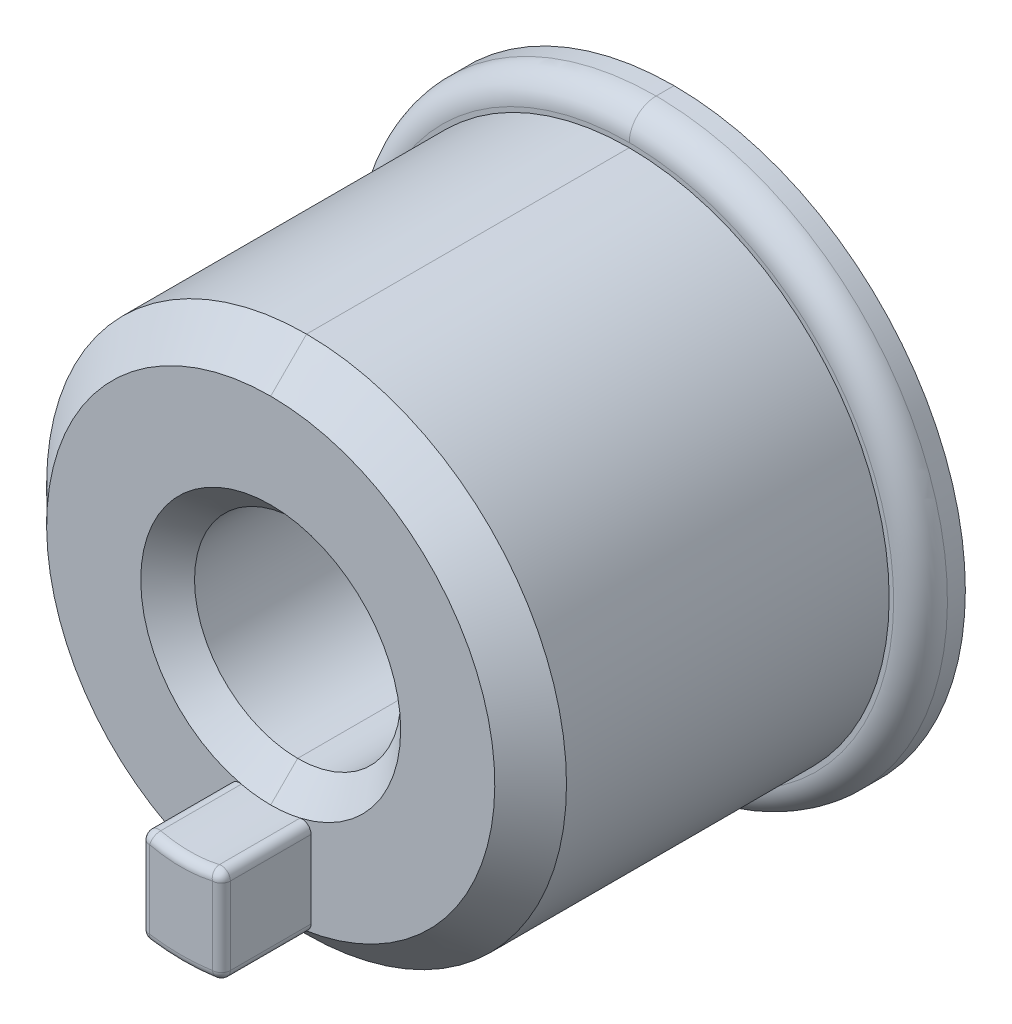
ISO-10303-21;
HEADER;
FILE_DESCRIPTION(('STEP AP214'),'2;1');
FILE_NAME('part.step','',(''),(''),'','','');
FILE_SCHEMA(('AUTOMOTIVE_DESIGN { 1 0 10303 214 1 1 1 1 }'));
ENDSEC;
DATA;
#1=APPLICATION_CONTEXT('core data for automotive mechanical design processes');
#2=APPLICATION_PROTOCOL_DEFINITION('international standard','automotive_design',2000,#1);
#3=PRODUCT_CONTEXT('',#1,'mechanical');
#4=PRODUCT('Part','Part','',(#3));
#5=PRODUCT_RELATED_PRODUCT_CATEGORY('part','',(#4));
#6=PRODUCT_DEFINITION_FORMATION('','',#4);
#7=PRODUCT_DEFINITION_CONTEXT('part definition',#1,'design');
#8=PRODUCT_DEFINITION('design','',#6,#7);
#9=PRODUCT_DEFINITION_SHAPE('','',#8);
#10=(LENGTH_UNIT() NAMED_UNIT(*) SI_UNIT(.MILLI.,.METRE.));
#11=(NAMED_UNIT(*) PLANE_ANGLE_UNIT() SI_UNIT($,.RADIAN.));
#12=(NAMED_UNIT(*) SI_UNIT($,.STERADIAN.) SOLID_ANGLE_UNIT());
#13=UNCERTAINTY_MEASURE_WITH_UNIT(LENGTH_MEASURE(1.E-05),#10,'distance_accuracy_value','');
#14=(GEOMETRIC_REPRESENTATION_CONTEXT(3) GLOBAL_UNCERTAINTY_ASSIGNED_CONTEXT((#13)) GLOBAL_UNIT_ASSIGNED_CONTEXT((#10,
#11,#12)) REPRESENTATION_CONTEXT('',''));
#15=CARTESIAN_POINT('',(0.,0.,0.));
#16=DIRECTION('',(0.,0.,1.));
#17=DIRECTION('',(1.,0.,0.));
#18=AXIS2_PLACEMENT_3D('',#15,#16,#17);
#19=CARTESIAN_POINT('',(0.35,-2.374342014117,20.8));
#20=DIRECTION('',(0.145833333332804,-0.989309172548725,0.));
#21=DIRECTION('',(1.13127562873E-12,1.667554982987E-13,-1.));
#22=AXIS2_PLACEMENT_3D('',#19,#20,#21);
#23=SPHERICAL_SURFACE('',#22,0.1);
#24=CARTESIAN_POINT('',(0.35,-2.374342014117,20.8));
#25=DIRECTION('',(0.,0.,-1.));
#26=DIRECTION('',(1.,0.,0.));
#27=AXIS2_PLACEMENT_3D('',#24,#25,#26);
#28=CIRCLE('',#27,0.1);
#29=CARTESIAN_POINT('',(0.45,-2.374342014117,20.8));
#30=VERTEX_POINT('',#29);
#31=CARTESIAN_POINT('',(0.3645834034215,-2.47327292104,20.8));
#32=VERTEX_POINT('',#31);
#33=EDGE_CURVE('E11',#30,#32,#28,.T.);
#34=ORIENTED_EDGE('',*,*,#33,.F.);
#35=CARTESIAN_POINT('',(0.35,-2.374342014117,20.8));
#36=DIRECTION('',(0.,1.,0.));
#37=DIRECTION('',(0.,0.,1.));
#38=AXIS2_PLACEMENT_3D('',#35,#36,#37);
#39=CIRCLE('',#38,0.1);
#40=CARTESIAN_POINT('',(0.3500000153566,-2.374342011853,20.9));
#41=VERTEX_POINT('',#40);
#42=EDGE_CURVE('E462',#41,#30,#39,.T.);
#43=ORIENTED_EDGE('',*,*,#42,.F.);
#44=CARTESIAN_POINT('',(0.35,-2.374342014117,20.8));
#45=DIRECTION('',(-0.989309172548725,-0.145833333332804,8.86110287343222E-13));
#46=DIRECTION('',(0.145833333332804,-0.989309172548725,0.));
#47=AXIS2_PLACEMENT_3D('',#44,#45,#46);
#48=CIRCLE('',#47,0.1);
#49=EDGE_CURVE('E288',#32,#41,#48,.T.);
#50=ORIENTED_EDGE('',*,*,#49,.F.);
#51=EDGE_LOOP('',(#34,#43,#50));
#52=FACE_BOUND('',#51,.T.);
#53=ADVANCED_FACE('F17',(#52),#23,.T.);
#54=CARTESIAN_POINT('',(0.35,-2.374342014117,20.95891989783));
#55=DIRECTION('',(0.,0.,-1.));
#56=DIRECTION('',(1.,0.,0.));
#57=AXIS2_PLACEMENT_3D('',#54,#55,#56);
#58=CYLINDRICAL_SURFACE('',#57,0.1);
#59=CARTESIAN_POINT('',(0.35,-2.374342014117,19.9));
#60=DIRECTION('',(0.,0.,1.));
#61=DIRECTION('',(0.145834735120993,-0.98930896591115,0.));
#62=AXIS2_PLACEMENT_3D('',#59,#60,#61);
#63=CIRCLE('',#62,0.1);
#64=CARTESIAN_POINT('',(0.3645834735121,-2.473272910708,19.9));
#65=VERTEX_POINT('',#64);
#66=CARTESIAN_POINT('',(0.45,-2.374342014117,19.9));
#67=VERTEX_POINT('',#66);
#68=EDGE_CURVE('E402',#65,#67,#63,.T.);
#69=ORIENTED_EDGE('',*,*,#68,.T.);
#70=DIRECTION('',(0.,0.,-1.));
#71=VECTOR('',#70,1.);
#72=CARTESIAN_POINT('',(0.45,-2.374342014117,20.8));
#73=LINE('',#72,#71);
#74=EDGE_CURVE('E361',#30,#67,#73,.T.);
#75=ORIENTED_EDGE('',*,*,#74,.F.);
#76=ORIENTED_EDGE('',*,*,#33,.T.);
#77=DIRECTION('',(-7.78765045660198E-08,-1.14798333802E-08,1.));
#78=VECTOR('',#77,1.);
#79=CARTESIAN_POINT('',(0.3645834384663,-2.473272915874,19.9));
#80=LINE('',#79,#78);
#81=EDGE_CURVE('E315',#65,#32,#80,.T.);
#82=ORIENTED_EDGE('',*,*,#81,.F.);
#83=EDGE_LOOP('',(#69,#75,#76,#82));
#84=FACE_BOUND('',#83,.T.);
#85=ADVANCED_FACE('F19',(#84),#58,.T.);
#86=CARTESIAN_POINT('',(0.,0.,-0.325));
#87=DIRECTION('',(0.,0.,1.));
#88=DIRECTION('',(-1.,0.,0.));
#89=AXIS2_PLACEMENT_3D('',#86,#87,#88);
#90=CYLINDRICAL_SURFACE('',#89,1.15);
#91=DIRECTION('',(0.,0.,1.));
#92=VECTOR('',#91,1.);
#93=CARTESIAN_POINT('',(0.,1.15,15.4));
#94=LINE('',#93,#92);
#95=CARTESIAN_POINT('',(0.,1.15,15.4));
#96=VERTEX_POINT('',#95);
#97=CARTESIAN_POINT('',(0.,1.15,19.6));
#98=VERTEX_POINT('',#97);
#99=EDGE_CURVE('E534',#96,#98,#94,.T.);
#100=ORIENTED_EDGE('',*,*,#99,.T.);
#101=CARTESIAN_POINT('',(0.,0.,19.6));
#102=DIRECTION('',(0.,0.,1.));
#103=DIRECTION('',(0.,1.,0.));
#104=AXIS2_PLACEMENT_3D('',#101,#102,#103);
#105=CIRCLE('',#104,1.15);
#106=CARTESIAN_POINT('',(-1.15,0.,19.6));
#107=VERTEX_POINT('',#106);
#108=EDGE_CURVE('E21',#98,#107,#105,.T.);
#109=ORIENTED_EDGE('',*,*,#108,.T.);
#110=CARTESIAN_POINT('',(0.,0.,19.6));
#111=DIRECTION('',(0.,0.,1.));
#112=DIRECTION('',(-1.,0.,0.));
#113=AXIS2_PLACEMENT_3D('',#110,#111,#112);
#114=CIRCLE('',#113,1.15);
#115=CARTESIAN_POINT('',(0.,-1.15,19.6));
#116=VERTEX_POINT('',#115);
#117=EDGE_CURVE('E353',#107,#116,#114,.T.);
#118=ORIENTED_EDGE('',*,*,#117,.T.);
#119=DIRECTION('',(0.,0.,1.));
#120=VECTOR('',#119,1.);
#121=CARTESIAN_POINT('',(0.,-1.15,15.4));
#122=LINE('',#121,#120);
#123=CARTESIAN_POINT('',(0.,-1.15,15.4));
#124=VERTEX_POINT('',#123);
#125=EDGE_CURVE('E539',#124,#116,#122,.T.);
#126=ORIENTED_EDGE('',*,*,#125,.F.);
#127=CARTESIAN_POINT('',(0.,0.,15.4));
#128=DIRECTION('',(0.,0.,-1.));
#129=DIRECTION('',(0.,-1.,0.));
#130=AXIS2_PLACEMENT_3D('',#127,#128,#129);
#131=CIRCLE('',#130,1.15);
#132=CARTESIAN_POINT('',(-1.15,0.,15.4));
#133=VERTEX_POINT('',#132);
#134=EDGE_CURVE('E580',#124,#133,#131,.T.);
#135=ORIENTED_EDGE('',*,*,#134,.T.);
#136=CARTESIAN_POINT('',(0.,0.,15.4));
#137=DIRECTION('',(0.,0.,-1.));
#138=DIRECTION('',(-1.,0.,0.));
#139=AXIS2_PLACEMENT_3D('',#136,#137,#138);
#140=CIRCLE('',#139,1.15);
#141=EDGE_CURVE('E574',#133,#96,#140,.T.);
#142=ORIENTED_EDGE('',*,*,#141,.T.);
#143=EDGE_LOOP('',(#100,#109,#118,#126,#135,#142));
#144=FACE_BOUND('',#143,.T.);
#145=ADVANCED_FACE('F620',(#144),#90,.F.);
#146=CARTESIAN_POINT('',(0.,0.,19.75));
#147=DIRECTION('',(0.,0.,1.));
#148=DIRECTION('',(-1.,0.,0.));
#149=AXIS2_PLACEMENT_3D('',#146,#147,#148);
#150=CONICAL_SURFACE('',#149,1.3,0.7853981633973);
#151=DIRECTION('',(0.,-0.707106781186548,-0.707106781186548));
#152=VECTOR('',#151,1.);
#153=CARTESIAN_POINT('',(0.,1.45,19.9));
#154=LINE('',#153,#152);
#155=CARTESIAN_POINT('',(0.,1.45,19.9));
#156=VERTEX_POINT('',#155);
#157=EDGE_CURVE('E27',#156,#98,#154,.T.);
#158=ORIENTED_EDGE('',*,*,#157,.T.);
#159=CARTESIAN_POINT('',(0.,0.,19.6));
#160=DIRECTION('',(0.,0.,1.));
#161=DIRECTION('',(1.,0.,0.));
#162=AXIS2_PLACEMENT_3D('',#159,#160,#161);
#163=CIRCLE('',#162,1.15);
#164=CARTESIAN_POINT('',(1.15,0.,19.6));
#165=VERTEX_POINT('',#164);
#166=EDGE_CURVE('E527',#165,#98,#163,.T.);
#167=ORIENTED_EDGE('',*,*,#166,.F.);
#168=CARTESIAN_POINT('',(0.,0.,19.6));
#169=DIRECTION('',(0.,0.,1.));
#170=DIRECTION('',(0.,-1.,0.));
#171=AXIS2_PLACEMENT_3D('',#168,#169,#170);
#172=CIRCLE('',#171,1.15);
#173=EDGE_CURVE('E529',#116,#165,#172,.T.);
#174=ORIENTED_EDGE('',*,*,#173,.F.);
#175=DIRECTION('',(0.,0.707106781186548,-0.707106781186548));
#176=VECTOR('',#175,1.);
#177=CARTESIAN_POINT('',(0.,-1.45,19.9));
#178=LINE('',#177,#176);
#179=CARTESIAN_POINT('',(0.,-1.45,19.9));
#180=VERTEX_POINT('',#179);
#181=EDGE_CURVE('E49',#180,#116,#178,.T.);
#182=ORIENTED_EDGE('',*,*,#181,.F.);
#183=CARTESIAN_POINT('',(0.,0.,19.9));
#184=DIRECTION('',(0.,0.,-1.));
#185=DIRECTION('',(0.225806455925002,-0.974172184196711,0.));
#186=AXIS2_PLACEMENT_3D('',#183,#184,#185);
#187=CIRCLE('',#186,1.45);
#188=CARTESIAN_POINT('',(0.3274193881866,-1.412549660805,19.9));
#189=VERTEX_POINT('',#188);
#190=EDGE_CURVE('E434',#189,#180,#187,.T.);
#191=ORIENTED_EDGE('',*,*,#190,.F.);
#192=CARTESIAN_POINT('',(0.,0.,19.9));
#193=DIRECTION('',(0.,0.,1.));
#194=DIRECTION('',(0.225806474611502,-0.974172179865308,0.));
#195=AXIS2_PLACEMENT_3D('',#192,#193,#194);
#196=CIRCLE('',#195,1.45);
#197=CARTESIAN_POINT('',(1.45,0.,19.9));
#198=VERTEX_POINT('',#197);
#199=EDGE_CURVE('E377',#189,#198,#196,.T.);
#200=ORIENTED_EDGE('',*,*,#199,.T.);
#201=CARTESIAN_POINT('',(0.,0.,19.9));
#202=DIRECTION('',(0.,0.,1.));
#203=DIRECTION('',(1.,0.,0.));
#204=AXIS2_PLACEMENT_3D('',#201,#202,#203);
#205=CIRCLE('',#204,1.45);
#206=EDGE_CURVE('E373',#198,#156,#205,.T.);
#207=ORIENTED_EDGE('',*,*,#206,.T.);
#208=EDGE_LOOP('',(#158,#167,#174,#182,#191,#200,#207));
#209=FACE_BOUND('',#208,.T.);
#210=ADVANCED_FACE('F517',(#209),#150,.F.);
#211=CARTESIAN_POINT('',(0.,0.,19.75));
#212=DIRECTION('',(0.,0.,1.));
#213=DIRECTION('',(-1.,0.,0.));
#214=AXIS2_PLACEMENT_3D('',#211,#212,#213);
#215=CONICAL_SURFACE('',#214,1.3,0.7853981633973);
#216=CARTESIAN_POINT('',(0.,0.,19.9));
#217=DIRECTION('',(0.,0.,-1.));
#218=DIRECTION('',(0.,-1.,0.));
#219=AXIS2_PLACEMENT_3D('',#216,#217,#218);
#220=CIRCLE('',#219,1.45);
#221=CARTESIAN_POINT('',(-0.3274193267035,-1.412549675056,19.9));
#222=VERTEX_POINT('',#221);
#223=EDGE_CURVE('E430',#180,#222,#220,.T.);
#224=ORIENTED_EDGE('',*,*,#223,.F.);
#225=ORIENTED_EDGE('',*,*,#181,.T.);
#226=ORIENTED_EDGE('',*,*,#117,.F.);
#227=ORIENTED_EDGE('',*,*,#108,.F.);
#228=ORIENTED_EDGE('',*,*,#157,.F.);
#229=CARTESIAN_POINT('',(0.,0.,19.9));
#230=DIRECTION('',(0.,0.,1.));
#231=DIRECTION('',(0.,1.,0.));
#232=AXIS2_PLACEMENT_3D('',#229,#230,#231);
#233=CIRCLE('',#232,1.45);
#234=CARTESIAN_POINT('',(-1.45,0.,19.9));
#235=VERTEX_POINT('',#234);
#236=EDGE_CURVE('E370',#156,#235,#233,.T.);
#237=ORIENTED_EDGE('',*,*,#236,.T.);
#238=CARTESIAN_POINT('',(0.,0.,19.9));
#239=DIRECTION('',(0.,0.,1.));
#240=DIRECTION('',(-1.,0.,0.));
#241=AXIS2_PLACEMENT_3D('',#238,#239,#240);
#242=CIRCLE('',#241,1.45);
#243=EDGE_CURVE('E366',#235,#222,#242,.T.);
#244=ORIENTED_EDGE('',*,*,#243,.T.);
#245=EDGE_LOOP('',(#224,#225,#226,#227,#228,#237,#244));
#246=FACE_BOUND('',#245,.T.);
#247=ADVANCED_FACE('F525',(#246),#215,.F.);
#248=CARTESIAN_POINT('',(-0.35,-1.509966887054,20.95891989783));
#249=DIRECTION('',(0.,0.,-1.));
#250=DIRECTION('',(-1.,0.,0.));
#251=AXIS2_PLACEMENT_3D('',#248,#249,#250);
#252=CYLINDRICAL_SURFACE('',#251,0.1);
#253=CARTESIAN_POINT('',(-0.35,-1.509966887054,19.9));
#254=DIRECTION('',(0.,0.,1.));
#255=DIRECTION('',(0.225806732964998,0.974172119980691,0.));
#256=AXIS2_PLACEMENT_3D('',#253,#254,#255);
#257=CIRCLE('',#256,0.1);
#258=CARTESIAN_POINT('',(-0.45,-1.509966887054,19.9));
#259=VERTEX_POINT('',#258);
#260=EDGE_CURVE('E362',#222,#259,#257,.T.);
#261=ORIENTED_EDGE('',*,*,#260,.T.);
#262=DIRECTION('',(0.,0.,-1.));
#263=VECTOR('',#262,1.);
#264=CARTESIAN_POINT('',(-0.45,-1.509966887054,20.8));
#265=LINE('',#264,#263);
#266=CARTESIAN_POINT('',(-0.45,-1.509966887054,20.8));
#267=VERTEX_POINT('',#266);
#268=EDGE_CURVE('E421',#267,#259,#265,.T.);
#269=ORIENTED_EDGE('',*,*,#268,.F.);
#270=CARTESIAN_POINT('',(-0.35,-1.509966887054,20.8));
#271=DIRECTION('',(0.,0.,-1.));
#272=DIRECTION('',(-1.,0.,0.));
#273=AXIS2_PLACEMENT_3D('',#270,#271,#272);
#274=CIRCLE('',#273,0.1);
#275=CARTESIAN_POINT('',(-0.3274193548386,-1.412549668534,20.8));
#276=VERTEX_POINT('',#275);
#277=EDGE_CURVE('E393',#267,#276,#274,.T.);
#278=ORIENTED_EDGE('',*,*,#277,.T.);
#279=DIRECTION('',(-1.172304247504E-08,2.717348321666E-09,1.));
#280=VECTOR('',#279,1.);
#281=CARTESIAN_POINT('',(-0.3274193372539,-1.412549672611,19.9));
#282=LINE('',#281,#280);
#283=EDGE_CURVE('E383',#222,#276,#282,.T.);
#284=ORIENTED_EDGE('',*,*,#283,.F.);
#285=EDGE_LOOP('',(#261,#269,#278,#284));
#286=FACE_BOUND('',#285,.T.);
#287=ADVANCED_FACE('F495',(#286),#252,.T.);
#288=CARTESIAN_POINT('',(0.,0.,19.9));
#289=DIRECTION('',(0.,0.,1.));
#290=DIRECTION('',(-1.,0.,0.));
#291=AXIS2_PLACEMENT_3D('',#288,#289,#290);
#292=CYLINDRICAL_SURFACE('',#291,1.45);
#293=DIRECTION('',(-1.56317744551E-08,-3.623311527355E-09,1.));
#294=VECTOR('',#293,1.);
#295=CARTESIAN_POINT('',(0.3274193704704,-1.412549664911,19.9));
#296=LINE('',#295,#294);
#297=CARTESIAN_POINT('',(0.3274193610912,-1.412549667085,20.8));
#298=VERTEX_POINT('',#297);
#299=EDGE_CURVE('E360',#189,#298,#296,.T.);
#300=ORIENTED_EDGE('',*,*,#299,.F.);
#301=ORIENTED_EDGE('',*,*,#190,.T.);
#302=ORIENTED_EDGE('',*,*,#223,.T.);
#303=ORIENTED_EDGE('',*,*,#283,.T.);
#304=CARTESIAN_POINT('',(0.,0.,20.8));
#305=DIRECTION('',(0.,0.,1.));
#306=DIRECTION('',(-0.225806441910801,-0.974172187445107,0.));
#307=AXIS2_PLACEMENT_3D('',#304,#305,#306);
#308=CIRCLE('',#307,1.45);
#309=EDGE_CURVE('E444',#276,#298,#308,.T.);
#310=ORIENTED_EDGE('',*,*,#309,.T.);
#311=EDGE_LOOP('',(#300,#301,#302,#303,#310));
#312=FACE_BOUND('',#311,.T.);
#313=ADVANCED_FACE('F483',(#312),#292,.F.);
#314=CARTESIAN_POINT('',(0.35,-1.509966887054,20.8));
#315=DIRECTION('',(-0.225806451614395,0.97417218519588,0.));
#316=DIRECTION('',(5.849210005238E-13,1.355027201555E-13,1.));
#317=AXIS2_PLACEMENT_3D('',#314,#315,#316);
#318=SPHERICAL_SURFACE('',#317,0.1);
#319=CARTESIAN_POINT('',(0.35,-1.509966887054,20.8));
#320=DIRECTION('',(0.,0.,-1.));
#321=DIRECTION('',(-0.225806451612906,0.974172185196225,0.));
#322=AXIS2_PLACEMENT_3D('',#319,#320,#321);
#323=CIRCLE('',#322,0.1);
#324=CARTESIAN_POINT('',(0.45,-1.509966887054,20.8));
#325=VERTEX_POINT('',#324);
#326=EDGE_CURVE('E472',#298,#325,#323,.T.);
#327=ORIENTED_EDGE('',*,*,#326,.F.);
#328=CARTESIAN_POINT('',(0.35,-1.509966887054,20.8));
#329=DIRECTION('',(0.974172185196225,0.225806451612906,0.));
#330=DIRECTION('',(-0.225806451612906,0.974172185196225,0.));
#331=AXIS2_PLACEMENT_3D('',#328,#329,#330);
#332=CIRCLE('',#331,0.1);
#333=CARTESIAN_POINT('',(0.3281103165756,-1.415530609514,20.82454854871));
#334=VERTEX_POINT('',#333);
#335=EDGE_CURVE('E441',#298,#334,#332,.T.);
#336=ORIENTED_EDGE('',*,*,#335,.T.);
#337=CARTESIAN_POINT('',(0.35,-1.509966887054,20.8));
#338=DIRECTION('',(0.974172185196222,0.225806451612918,0.));
#339=DIRECTION('',(-0.218896834244403,0.944362775400014,0.245485487140403));
#340=AXIS2_PLACEMENT_3D('',#337,#338,#339);
#341=CIRCLE('',#340,0.1);
#342=CARTESIAN_POINT('',(0.350000083516,-1.509966867696,20.9));
#343=VERTEX_POINT('',#342);
#344=EDGE_CURVE('E392',#334,#343,#341,.T.);
#345=ORIENTED_EDGE('',*,*,#344,.T.);
#346=CARTESIAN_POINT('',(0.35,-1.509966887054,20.8));
#347=DIRECTION('',(0.,-1.,0.));
#348=DIRECTION('',(1.,0.,0.));
#349=AXIS2_PLACEMENT_3D('',#346,#347,#348);
#350=CIRCLE('',#349,0.1);
#351=EDGE_CURVE('E456',#325,#343,#350,.T.);
#352=ORIENTED_EDGE('',*,*,#351,.F.);
#353=EDGE_LOOP('',(#327,#336,#345,#352));
#354=FACE_BOUND('',#353,.T.);
#355=ADVANCED_FACE('F512',(#354),#318,.T.);
#356=CARTESIAN_POINT('',(0.35,-1.509966887054,20.95891989783));
#357=DIRECTION('',(0.,0.,-1.));
#358=DIRECTION('',(-0.225806451612906,0.974172185196225,0.));
#359=AXIS2_PLACEMENT_3D('',#356,#357,#358);
#360=CYLINDRICAL_SURFACE('',#359,0.1);
#361=CARTESIAN_POINT('',(0.35,-1.509966887054,19.9));
#362=DIRECTION('',(0.,0.,1.));
#363=DIRECTION('',(1.,0.,0.));
#364=AXIS2_PLACEMENT_3D('',#361,#362,#363);
#365=CIRCLE('',#364,0.1);
#366=CARTESIAN_POINT('',(0.45,-1.509966887054,19.9));
#367=VERTEX_POINT('',#366);
#368=EDGE_CURVE('E380',#367,#189,#365,.T.);
#369=ORIENTED_EDGE('',*,*,#368,.T.);
#370=ORIENTED_EDGE('',*,*,#299,.T.);
#371=ORIENTED_EDGE('',*,*,#326,.T.);
#372=DIRECTION('',(0.,0.,1.));
#373=VECTOR('',#372,1.);
#374=CARTESIAN_POINT('',(0.45,-1.509966887054,19.9));
#375=LINE('',#374,#373);
#376=EDGE_CURVE('E356',#367,#325,#375,.T.);
#377=ORIENTED_EDGE('',*,*,#376,.F.);
#378=EDGE_LOOP('',(#369,#370,#371,#377));
#379=FACE_BOUND('',#378,.T.);
#380=ADVANCED_FACE('F514',(#379),#360,.T.);
#381=CARTESIAN_POINT('',(0.45,-2.459166525472,19.9));
#382=DIRECTION('',(1.,0.,0.));
#383=DIRECTION('',(0.,1.,0.));
#384=AXIS2_PLACEMENT_3D('',#381,#382,#383);
#385=PLANE('',#384);
#386=ORIENTED_EDGE('',*,*,#74,.T.);
#387=DIRECTION('',(0.,-1.,0.));
#388=VECTOR('',#387,1.);
#389=CARTESIAN_POINT('',(0.45,-1.509966887054,19.9));
#390=LINE('',#389,#388);
#391=EDGE_CURVE('E387',#367,#67,#390,.T.);
#392=ORIENTED_EDGE('',*,*,#391,.F.);
#393=ORIENTED_EDGE('',*,*,#376,.T.);
#394=DIRECTION('',(0.,-1.,0.));
#395=VECTOR('',#394,1.);
#396=CARTESIAN_POINT('',(0.45,-1.509966887054,20.8));
#397=LINE('',#396,#395);
#398=EDGE_CURVE('E459',#325,#30,#397,.T.);
#399=ORIENTED_EDGE('',*,*,#398,.T.);
#400=EDGE_LOOP('',(#386,#392,#393,#399));
#401=FACE_BOUND('',#400,.T.);
#402=ADVANCED_FACE('F642',(#401),#385,.T.);
#403=CARTESIAN_POINT('',(0.35,-2.517065265568,20.8));
#404=DIRECTION('',(0.,1.,0.));
#405=DIRECTION('',(0.,0.,1.));
#406=AXIS2_PLACEMENT_3D('',#403,#404,#405);
#407=CYLINDRICAL_SURFACE('',#406,0.1);
#408=ORIENTED_EDGE('',*,*,#351,.T.);
#409=DIRECTION('',(0.,1.,0.));
#410=VECTOR('',#409,1.);
#411=CARTESIAN_POINT('',(0.35,-2.374341987507,20.9));
#412=LINE('',#411,#410);
#413=EDGE_CURVE('E452',#41,#343,#412,.T.);
#414=ORIENTED_EDGE('',*,*,#413,.F.);
#415=ORIENTED_EDGE('',*,*,#42,.T.);
#416=ORIENTED_EDGE('',*,*,#398,.F.);
#417=EDGE_LOOP('',(#408,#414,#415,#416));
#418=FACE_BOUND('',#417,.T.);
#419=ADVANCED_FACE('F641',(#418),#407,.T.);
#420=CARTESIAN_POINT('',(0.,0.,20.9));
#421=DIRECTION('',(0.,0.,1.));
#422=DIRECTION('',(1.,0.,0.));
#423=AXIS2_PLACEMENT_3D('',#420,#421,#422);
#424=PLANE('',#423);
#425=ORIENTED_EDGE('',*,*,#413,.T.);
#426=CARTESIAN_POINT('',(0.,0.,20.9));
#427=DIRECTION('',(0.,0.,1.));
#428=DIRECTION('',(-0.225806531430204,-0.974172166695118,0.));
#429=AXIS2_PLACEMENT_3D('',#426,#427,#428);
#430=CIRCLE('',#429,1.55);
#431=CARTESIAN_POINT('',(-0.35,-1.509966887054,20.9));
#432=VERTEX_POINT('',#431);
#433=EDGE_CURVE('E448',#432,#343,#430,.T.);
#434=ORIENTED_EDGE('',*,*,#433,.F.);
#435=DIRECTION('',(0.,-1.,0.));
#436=VECTOR('',#435,1.);
#437=CARTESIAN_POINT('',(-0.3500000000001,-1.50996674645,20.9));
#438=LINE('',#437,#436);
#439=CARTESIAN_POINT('',(-0.35,-2.374342014117,20.9));
#440=VERTEX_POINT('',#439);
#441=EDGE_CURVE('E394',#432,#440,#438,.T.);
#442=ORIENTED_EDGE('',*,*,#441,.T.);
#443=CARTESIAN_POINT('',(0.,0.,20.9));
#444=DIRECTION('',(0.,0.,-1.));
#445=DIRECTION('',(0.145833339731906,-0.989309171605438,0.));
#446=AXIS2_PLACEMENT_3D('',#443,#444,#445);
#447=CIRCLE('',#446,2.4);
#448=EDGE_CURVE('E283',#41,#440,#447,.T.);
#449=ORIENTED_EDGE('',*,*,#448,.F.);
#450=EDGE_LOOP('',(#425,#434,#442,#449));
#451=FACE_BOUND('',#450,.T.);
#452=ADVANCED_FACE('F508',(#451),#424,.T.);
#453=CARTESIAN_POINT('',(0.,0.,20.8));
#454=DIRECTION('',(0.,0.,1.));
#455=DIRECTION('',(0.329478135153205,-0.944163205413114,0.));
#456=AXIS2_PLACEMENT_3D('',#453,#454,#455);
#457=TOROIDAL_SURFACE('',#456,1.55,0.1);
#458=ORIENTED_EDGE('',*,*,#344,.F.);
#459=ORIENTED_EDGE('',*,*,#335,.F.);
#460=ORIENTED_EDGE('',*,*,#309,.F.);
#461=CARTESIAN_POINT('',(-0.35,-1.509966887054,20.8));
#462=DIRECTION('',(0.97417218519588,-0.225806451614395,2.64455941183294E-12));
#463=DIRECTION('',(0.225806451614395,0.97417218519588,0.));
#464=AXIS2_PLACEMENT_3D('',#461,#462,#463);
#465=CIRCLE('',#464,0.1);
#466=EDGE_CURVE('E388',#276,#432,#465,.T.);
#467=ORIENTED_EDGE('',*,*,#466,.T.);
#468=ORIENTED_EDGE('',*,*,#433,.T.);
#469=EDGE_LOOP('',(#458,#459,#460,#467,#468));
#470=FACE_BOUND('',#469,.T.);
#471=ADVANCED_FACE('F489',(#470),#457,.T.);
#472=CARTESIAN_POINT('',(-0.35,-1.509966887054,20.8));
#473=DIRECTION('',(0.225806451614395,0.97417218519588,0.));
#474=DIRECTION('',(-3.40907857499E-12,7.905343046843E-13,-1.));
#475=AXIS2_PLACEMENT_3D('',#472,#473,#474);
#476=SPHERICAL_SURFACE('',#475,0.1);
#477=ORIENTED_EDGE('',*,*,#277,.F.);
#478=CARTESIAN_POINT('',(-0.35,-1.509966887054,20.8));
#479=DIRECTION('',(0.,-1.,0.));
#480=DIRECTION('',(0.,0.,1.));
#481=AXIS2_PLACEMENT_3D('',#478,#479,#480);
#482=CIRCLE('',#481,0.1);
#483=EDGE_CURVE('E397',#432,#267,#482,.T.);
#484=ORIENTED_EDGE('',*,*,#483,.F.);
#485=ORIENTED_EDGE('',*,*,#466,.F.);
#486=EDGE_LOOP('',(#477,#484,#485));
#487=FACE_BOUND('',#486,.T.);
#488=ADVANCED_FACE('F492',(#487),#476,.T.);
#489=CARTESIAN_POINT('',(-0.35,-1.32162217919,20.8));
#490=DIRECTION('',(0.,-1.,0.));
#491=DIRECTION('',(0.,0.,1.));
#492=AXIS2_PLACEMENT_3D('',#489,#490,#491);
#493=CYLINDRICAL_SURFACE('',#492,0.1);
#494=CARTESIAN_POINT('',(-0.35,-2.374342014117,20.8));
#495=DIRECTION('',(0.,1.,0.));
#496=DIRECTION('',(-1.,0.,0.));
#497=AXIS2_PLACEMENT_3D('',#494,#495,#496);
#498=CIRCLE('',#497,0.1);
#499=CARTESIAN_POINT('',(-0.45,-2.374342014117,20.8));
#500=VERTEX_POINT('',#499);
#501=EDGE_CURVE('E295',#500,#440,#498,.T.);
#502=ORIENTED_EDGE('',*,*,#501,.T.);
#503=ORIENTED_EDGE('',*,*,#441,.F.);
#504=ORIENTED_EDGE('',*,*,#483,.T.);
#505=DIRECTION('',(0.,1.,0.));
#506=VECTOR('',#505,1.);
#507=CARTESIAN_POINT('',(-0.45,-2.374342014117,20.8));
#508=LINE('',#507,#506);
#509=EDGE_CURVE('E398',#500,#267,#508,.T.);
#510=ORIENTED_EDGE('',*,*,#509,.F.);
#511=EDGE_LOOP('',(#502,#503,#504,#510));
#512=FACE_BOUND('',#511,.T.);
#513=ADVANCED_FACE('F504',(#512),#493,.T.);
#514=CARTESIAN_POINT('',(-0.45,-1.378404875209,19.9));
#515=DIRECTION('',(-1.,0.,0.));
#516=DIRECTION('',(0.,0.,1.));
#517=AXIS2_PLACEMENT_3D('',#514,#515,#516);
#518=PLANE('',#517);
#519=ORIENTED_EDGE('',*,*,#268,.T.);
#520=DIRECTION('',(0.,1.,0.));
#521=VECTOR('',#520,1.);
#522=CARTESIAN_POINT('',(-0.45,-2.374342014117,19.9));
#523=LINE('',#522,#521);
#524=CARTESIAN_POINT('',(-0.45,-2.374342014117,19.9));
#525=VERTEX_POINT('',#524);
#526=EDGE_CURVE('E352',#525,#259,#523,.T.);
#527=ORIENTED_EDGE('',*,*,#526,.F.);
#528=DIRECTION('',(0.,0.,1.));
#529=VECTOR('',#528,1.);
#530=CARTESIAN_POINT('',(-0.45,-2.374342014117,19.9));
#531=LINE('',#530,#529);
#532=EDGE_CURVE('E294',#525,#500,#531,.T.);
#533=ORIENTED_EDGE('',*,*,#532,.T.);
#534=ORIENTED_EDGE('',*,*,#509,.T.);
#535=EDGE_LOOP('',(#519,#527,#533,#534));
#536=FACE_BOUND('',#535,.T.);
#537=ADVANCED_FACE('F500',(#536),#518,.T.);
#538=CARTESIAN_POINT('',(-0.35,-2.374342014117,20.95891989783));
#539=DIRECTION('',(0.,0.,-1.));
#540=DIRECTION('',(-0.145833333333293,-0.989309172548653,0.));
#541=AXIS2_PLACEMENT_3D('',#538,#539,#540);
#542=CYLINDRICAL_SURFACE('',#541,0.1);
#543=CARTESIAN_POINT('',(-0.35,-2.374342014117,19.9));
#544=DIRECTION('',(0.,0.,1.));
#545=DIRECTION('',(-1.,0.,0.));
#546=AXIS2_PLACEMENT_3D('',#543,#544,#545);
#547=CIRCLE('',#546,0.1);
#548=CARTESIAN_POINT('',(-0.3645837074078,-2.473272876229,19.9));
#549=VERTEX_POINT('',#548);
#550=EDGE_CURVE('E348',#525,#549,#547,.T.);
#551=ORIENTED_EDGE('',*,*,#550,.T.);
#552=DIRECTION('',(1.55865340017398E-07,-2.29759312809897E-08,0.999999999999988));
#553=VECTOR('',#552,1.);
#554=CARTESIAN_POINT('',(-0.3645834911471,-2.473272908109,19.9));
#555=LINE('',#554,#553);
#556=CARTESIAN_POINT('',(-0.3645834034734,-2.473272921032,20.8));
#557=VERTEX_POINT('',#556);
#558=EDGE_CURVE('E337',#549,#557,#555,.T.);
#559=ORIENTED_EDGE('',*,*,#558,.T.);
#560=CARTESIAN_POINT('',(-0.35,-2.374342014117,20.8));
#561=DIRECTION('',(0.,0.,-1.));
#562=DIRECTION('',(-0.145833333333293,-0.989309172548653,0.));
#563=AXIS2_PLACEMENT_3D('',#560,#561,#562);
#564=CIRCLE('',#563,0.1);
#565=EDGE_CURVE('E291',#557,#500,#564,.T.);
#566=ORIENTED_EDGE('',*,*,#565,.T.);
#567=ORIENTED_EDGE('',*,*,#532,.F.);
#568=EDGE_LOOP('',(#551,#559,#566,#567));
#569=FACE_BOUND('',#568,.T.);
#570=ADVANCED_FACE('F629',(#569),#542,.T.);
#571=CARTESIAN_POINT('',(-0.35,-2.374342014117,20.8));
#572=DIRECTION('',(-0.145833333332804,-0.989309172548725,0.));
#573=DIRECTION('',(-1.941086180679E-13,0.,1.));
#574=AXIS2_PLACEMENT_3D('',#571,#572,#573);
#575=SPHERICAL_SURFACE('',#574,0.1);
#576=ORIENTED_EDGE('',*,*,#501,.F.);
#577=ORIENTED_EDGE('',*,*,#565,.F.);
#578=CARTESIAN_POINT('',(-0.35,-2.374342014117,20.8));
#579=DIRECTION('',(-0.989309172548651,0.145833333333307,0.));
#580=DIRECTION('',(-0.145833333333307,-0.989309172548651,0.));
#581=AXIS2_PLACEMENT_3D('',#578,#579,#580);
#582=CIRCLE('',#581,0.1);
#583=CARTESIAN_POINT('',(-0.3641370872116,-2.470245671613,20.82454854871));
#584=VERTEX_POINT('',#583);
#585=EDGE_CURVE('E414',#557,#584,#582,.T.);
#586=ORIENTED_EDGE('',*,*,#585,.T.);
#587=CARTESIAN_POINT('',(-0.35,-2.374342014117,20.8));
#588=DIRECTION('',(-0.989309172548643,0.14583333333336,0.));
#589=DIRECTION('',(-0.141370872116203,-0.959036574965022,0.245485487140206));
#590=AXIS2_PLACEMENT_3D('',#587,#588,#589);
#591=CIRCLE('',#590,0.1);
#592=EDGE_CURVE('E287',#584,#440,#591,.T.);
#593=ORIENTED_EDGE('',*,*,#592,.T.);
#594=EDGE_LOOP('',(#576,#577,#586,#593));
#595=FACE_BOUND('',#594,.T.);
#596=ADVANCED_FACE('F625',(#595),#575,.T.);
#597=CARTESIAN_POINT('',(0.,0.,20.8));
#598=DIRECTION('',(0.,0.,1.));
#599=DIRECTION('',(-0.202730916072899,-0.979234484517495,0.));
#600=AXIS2_PLACEMENT_3D('',#597,#598,#599);
#601=TOROIDAL_SURFACE('',#600,2.4,0.1);
#602=ORIENTED_EDGE('',*,*,#49,.T.);
#603=ORIENTED_EDGE('',*,*,#448,.T.);
#604=ORIENTED_EDGE('',*,*,#592,.F.);
#605=ORIENTED_EDGE('',*,*,#585,.F.);
#606=CARTESIAN_POINT('',(0.,0.,20.8));
#607=DIRECTION('',(0.,0.,-1.));
#608=DIRECTION('',(0.145833361368598,-0.989309168415989,0.));
#609=AXIS2_PLACEMENT_3D('',#606,#607,#608);
#610=CIRCLE('',#609,2.5);
#611=EDGE_CURVE('E311',#32,#557,#610,.T.);
#612=ORIENTED_EDGE('',*,*,#611,.F.);
#613=EDGE_LOOP('',(#602,#603,#604,#605,#612));
#614=FACE_BOUND('',#613,.T.);
#615=ADVANCED_FACE('F628',(#614),#601,.T.);
#616=CARTESIAN_POINT('',(0.,0.,19.9));
#617=DIRECTION('',(0.,0.,1.));
#618=DIRECTION('',(-1.,0.,0.));
#619=AXIS2_PLACEMENT_3D('',#616,#617,#618);
#620=CYLINDRICAL_SURFACE('',#619,2.5);
#621=ORIENTED_EDGE('',*,*,#558,.F.);
#622=CARTESIAN_POINT('',(0.,0.,19.9));
#623=DIRECTION('',(0.,0.,1.));
#624=DIRECTION('',(-0.145833361389403,-0.989309168412922,0.));
#625=AXIS2_PLACEMENT_3D('',#622,#623,#624);
#626=CIRCLE('',#625,2.5);
#627=CARTESIAN_POINT('',(0.,-2.5,19.9));
#628=VERTEX_POINT('',#627);
#629=EDGE_CURVE('E341',#549,#628,#626,.T.);
#630=ORIENTED_EDGE('',*,*,#629,.T.);
#631=CARTESIAN_POINT('',(0.,0.,19.9));
#632=DIRECTION('',(0.,0.,1.));
#633=DIRECTION('',(0.,-1.,0.));
#634=AXIS2_PLACEMENT_3D('',#631,#632,#633);
#635=CIRCLE('',#634,2.5);
#636=EDGE_CURVE('E297',#628,#65,#635,.T.);
#637=ORIENTED_EDGE('',*,*,#636,.T.);
#638=ORIENTED_EDGE('',*,*,#81,.T.);
#639=ORIENTED_EDGE('',*,*,#611,.T.);
#640=EDGE_LOOP('',(#621,#630,#637,#638,#639));
#641=FACE_BOUND('',#640,.T.);
#642=ADVANCED_FACE('F741',(#641),#620,.T.);
#643=CARTESIAN_POINT('',(0.,0.,19.9));
#644=DIRECTION('',(0.,0.,1.));
#645=DIRECTION('',(0.,-1.,0.));
#646=AXIS2_PLACEMENT_3D('',#643,#644,#645);
#647=CYLINDRICAL_SURFACE('',#646,2.9);
#648=DIRECTION('',(0.,0.,1.));
#649=VECTOR('',#648,1.);
#650=CARTESIAN_POINT('',(0.,-2.9,15.9));
#651=LINE('',#650,#649);
#652=CARTESIAN_POINT('',(0.,-2.9,15.9));
#653=VERTEX_POINT('',#652);
#654=CARTESIAN_POINT('',(0.,-2.9,19.5));
#655=VERTEX_POINT('',#654);
#656=EDGE_CURVE('E319',#653,#655,#651,.T.);
#657=ORIENTED_EDGE('',*,*,#656,.F.);
#658=CARTESIAN_POINT('',(0.,0.,15.9));
#659=DIRECTION('',(0.,0.,1.));
#660=DIRECTION('',(0.,-1.,0.));
#661=AXIS2_PLACEMENT_3D('',#658,#659,#660);
#662=CIRCLE('',#661,2.9);
#663=CARTESIAN_POINT('',(0.,2.9,15.9));
#664=VERTEX_POINT('',#663);
#665=EDGE_CURVE('E252',#653,#664,#662,.T.);
#666=ORIENTED_EDGE('',*,*,#665,.T.);
#667=DIRECTION('',(0.,0.,1.));
#668=VECTOR('',#667,1.);
#669=CARTESIAN_POINT('',(0.,2.9,15.9));
#670=LINE('',#669,#668);
#671=CARTESIAN_POINT('',(0.,2.9,19.5));
#672=VERTEX_POINT('',#671);
#673=EDGE_CURVE('E310',#664,#672,#670,.T.);
#674=ORIENTED_EDGE('',*,*,#673,.T.);
#675=CARTESIAN_POINT('',(0.,0.,19.5));
#676=DIRECTION('',(0.,0.,-1.));
#677=DIRECTION('',(0.,1.,0.));
#678=AXIS2_PLACEMENT_3D('',#675,#676,#677);
#679=CIRCLE('',#678,2.9);
#680=EDGE_CURVE('E301',#672,#655,#679,.T.);
#681=ORIENTED_EDGE('',*,*,#680,.T.);
#682=EDGE_LOOP('',(#657,#666,#674,#681));
#683=FACE_BOUND('',#682,.T.);
#684=ADVANCED_FACE('F749',(#683),#647,.T.);
#685=CARTESIAN_POINT('',(0.,0.,19.7));
#686=DIRECTION('',(0.,0.,-1.));
#687=DIRECTION('',(0.,-1.,0.));
#688=AXIS2_PLACEMENT_3D('',#685,#686,#687);
#689=CONICAL_SURFACE('',#688,2.7,0.7853981633973);
#690=ORIENTED_EDGE('',*,*,#636,.F.);
#691=DIRECTION('',(0.,-0.707106781186548,-0.707106781186548));
#692=VECTOR('',#691,1.);
#693=CARTESIAN_POINT('',(0.,-2.5,19.9));
#694=LINE('',#693,#692);
#695=EDGE_CURVE('E334',#628,#655,#694,.T.);
#696=ORIENTED_EDGE('',*,*,#695,.T.);
#697=ORIENTED_EDGE('',*,*,#680,.F.);
#698=DIRECTION('',(0.,0.707106781186548,-0.707106781186548));
#699=VECTOR('',#698,1.);
#700=CARTESIAN_POINT('',(0.,2.5,19.9));
#701=LINE('',#700,#699);
#702=CARTESIAN_POINT('',(0.,2.5,19.9));
#703=VERTEX_POINT('',#702);
#704=EDGE_CURVE('E330',#703,#672,#701,.T.);
#705=ORIENTED_EDGE('',*,*,#704,.F.);
#706=CARTESIAN_POINT('',(0.,0.,19.9));
#707=DIRECTION('',(0.,0.,-1.));
#708=DIRECTION('',(0.,1.,0.));
#709=AXIS2_PLACEMENT_3D('',#706,#707,#708);
#710=CIRCLE('',#709,2.5);
#711=EDGE_CURVE('E302',#703,#65,#710,.T.);
#712=ORIENTED_EDGE('',*,*,#711,.T.);
#713=EDGE_LOOP('',(#690,#696,#697,#705,#712));
#714=FACE_BOUND('',#713,.T.);
#715=ADVANCED_FACE('F757',(#714),#689,.T.);
#716=CARTESIAN_POINT('',(0.,0.,19.9));
#717=DIRECTION('',(0.,0.,-1.));
#718=DIRECTION('',(0.,-1.,0.));
#719=AXIS2_PLACEMENT_3D('',#716,#717,#718);
#720=PLANE('',#719);
#721=CARTESIAN_POINT('',(0.,0.,19.9));
#722=DIRECTION('',(0.,0.,-1.));
#723=DIRECTION('',(-0.145833482963103,-0.989309150491822,0.));
#724=AXIS2_PLACEMENT_3D('',#721,#722,#723);
#725=CIRCLE('',#724,2.5);
#726=EDGE_CURVE('E345',#549,#703,#725,.T.);
#727=ORIENTED_EDGE('',*,*,#726,.F.);
#728=ORIENTED_EDGE('',*,*,#550,.F.);
#729=ORIENTED_EDGE('',*,*,#526,.T.);
#730=ORIENTED_EDGE('',*,*,#260,.F.);
#731=ORIENTED_EDGE('',*,*,#243,.F.);
#732=ORIENTED_EDGE('',*,*,#236,.F.);
#733=ORIENTED_EDGE('',*,*,#206,.F.);
#734=ORIENTED_EDGE('',*,*,#199,.F.);
#735=ORIENTED_EDGE('',*,*,#368,.F.);
#736=ORIENTED_EDGE('',*,*,#391,.T.);
#737=ORIENTED_EDGE('',*,*,#68,.F.);
#738=ORIENTED_EDGE('',*,*,#711,.F.);
#739=EDGE_LOOP('',(#727,#728,#729,#730,#731,#732,#733,#734,#735,#736,#737,#738));
#740=FACE_BOUND('',#739,.T.);
#741=ADVANCED_FACE('F522',(#740),#720,.F.);
#742=CARTESIAN_POINT('',(0.,0.,19.7));
#743=DIRECTION('',(0.,0.,-1.));
#744=DIRECTION('',(0.,-1.,0.));
#745=AXIS2_PLACEMENT_3D('',#742,#743,#744);
#746=CONICAL_SURFACE('',#745,2.7,0.7853981633973);
#747=ORIENTED_EDGE('',*,*,#704,.T.);
#748=CARTESIAN_POINT('',(0.,0.,19.5));
#749=DIRECTION('',(0.,0.,-1.));
#750=DIRECTION('',(0.,-1.,0.));
#751=AXIS2_PLACEMENT_3D('',#748,#749,#750);
#752=CIRCLE('',#751,2.9);
#753=EDGE_CURVE('E326',#655,#672,#752,.T.);
#754=ORIENTED_EDGE('',*,*,#753,.F.);
#755=ORIENTED_EDGE('',*,*,#695,.F.);
#756=ORIENTED_EDGE('',*,*,#629,.F.);
#757=ORIENTED_EDGE('',*,*,#726,.T.);
#758=EDGE_LOOP('',(#747,#754,#755,#756,#757));
#759=FACE_BOUND('',#758,.T.);
#760=ADVANCED_FACE('F771',(#759),#746,.T.);
#761=CARTESIAN_POINT('',(0.,0.,19.9));
#762=DIRECTION('',(0.,0.,1.));
#763=DIRECTION('',(0.,-1.,0.));
#764=AXIS2_PLACEMENT_3D('',#761,#762,#763);
#765=CYLINDRICAL_SURFACE('',#764,2.9);
#766=ORIENTED_EDGE('',*,*,#673,.F.);
#767=CARTESIAN_POINT('',(0.,0.,15.9));
#768=DIRECTION('',(0.,0.,1.));
#769=DIRECTION('',(0.,1.,0.));
#770=AXIS2_PLACEMENT_3D('',#767,#768,#769);
#771=CIRCLE('',#770,2.9);
#772=EDGE_CURVE('E306',#664,#653,#771,.T.);
#773=ORIENTED_EDGE('',*,*,#772,.T.);
#774=ORIENTED_EDGE('',*,*,#656,.T.);
#775=ORIENTED_EDGE('',*,*,#753,.T.);
#776=EDGE_LOOP('',(#766,#773,#774,#775));
#777=FACE_BOUND('',#776,.T.);
#778=ADVANCED_FACE('F777',(#777),#765,.T.);
#779=CARTESIAN_POINT('',(0.,0.,15.6));
#780=DIRECTION('',(0.,0.,-1.));
#781=DIRECTION('',(-0.0248416966838791,-0.999691397435162,0.));
#782=AXIS2_PLACEMENT_3D('',#779,#780,#781);
#783=TOROIDAL_SURFACE('',#782,2.95,0.3);
#784=CARTESIAN_POINT('',(0.,-2.95,15.6));
#785=DIRECTION('',(-1.,0.,0.));
#786=DIRECTION('',(0.,-1.,0.));
#787=AXIS2_PLACEMENT_3D('',#784,#785,#786);
#788=CIRCLE('',#787,0.3);
#789=CARTESIAN_POINT('',(0.,-3.25,15.6));
#790=VERTEX_POINT('',#789);
#791=CARTESIAN_POINT('',(0.,-2.949999467729,15.9));
#792=VERTEX_POINT('',#791);
#793=EDGE_CURVE('E268',#790,#792,#788,.T.);
#794=ORIENTED_EDGE('',*,*,#793,.F.);
#795=CARTESIAN_POINT('',(0.,0.,15.6));
#796=DIRECTION('',(0.,0.,-1.));
#797=DIRECTION('',(0.0248416966838791,0.999691397435162,0.));
#798=AXIS2_PLACEMENT_3D('',#795,#796,#797);
#799=CIRCLE('',#798,3.25);
#800=CARTESIAN_POINT('',(0.0807355142226,3.248997041664,15.6));
#801=VERTEX_POINT('',#800);
#802=EDGE_CURVE('E559',#801,#790,#799,.T.);
#803=ORIENTED_EDGE('',*,*,#802,.F.);
#804=CARTESIAN_POINT('',(0.,0.,15.6));
#805=DIRECTION('',(0.,0.,-1.));
#806=DIRECTION('',(1.39321547213E-13,1.,0.));
#807=AXIS2_PLACEMENT_3D('',#804,#805,#806);
#808=CIRCLE('',#807,3.25);
#809=CARTESIAN_POINT('',(0.,3.25,15.6));
#810=VERTEX_POINT('',#809);
#811=EDGE_CURVE('E265',#810,#801,#808,.T.);
#812=ORIENTED_EDGE('',*,*,#811,.F.);
#813=CARTESIAN_POINT('',(0.,2.95,15.6));
#814=DIRECTION('',(1.,0.,0.));
#815=DIRECTION('',(0.,1.,0.));
#816=AXIS2_PLACEMENT_3D('',#813,#814,#815);
#817=CIRCLE('',#816,0.3);
#818=CARTESIAN_POINT('',(0.,2.949999467729,15.9));
#819=VERTEX_POINT('',#818);
#820=EDGE_CURVE('E256',#810,#819,#817,.T.);
#821=ORIENTED_EDGE('',*,*,#820,.T.);
#822=CARTESIAN_POINT('',(0.,0.,15.9));
#823=DIRECTION('',(0.,0.,-1.));
#824=DIRECTION('',(0.,1.,0.));
#825=AXIS2_PLACEMENT_3D('',#822,#823,#824);
#826=CIRCLE('',#825,2.949999467729);
#827=CARTESIAN_POINT('',(0.07328299199492,2.949089090327,15.9));
#828=VERTEX_POINT('',#827);
#829=EDGE_CURVE('E242',#819,#828,#826,.T.);
#830=ORIENTED_EDGE('',*,*,#829,.T.);
#831=CARTESIAN_POINT('',(0.,0.,15.9));
#832=DIRECTION('',(0.,0.,-1.));
#833=DIRECTION('',(0.0248416966838791,0.999691397435162,0.));
#834=AXIS2_PLACEMENT_3D('',#831,#832,#833);
#835=CIRCLE('',#834,2.949999467729);
#836=EDGE_CURVE('E248',#828,#792,#835,.T.);
#837=ORIENTED_EDGE('',*,*,#836,.T.);
#838=EDGE_LOOP('',(#794,#803,#812,#821,#830,#837));
#839=FACE_BOUND('',#838,.T.);
#840=ADVANCED_FACE('F263',(#839),#783,.T.);
#841=CARTESIAN_POINT('',(0.,0.,15.9));
#842=DIRECTION('',(0.,0.,1.));
#843=DIRECTION('',(1.,0.,0.));
#844=AXIS2_PLACEMENT_3D('',#841,#842,#843);
#845=PLANE('',#844);
#846=ORIENTED_EDGE('',*,*,#665,.F.);
#847=ORIENTED_EDGE('',*,*,#772,.F.);
#848=EDGE_LOOP('',(#846,#847));
#849=FACE_BOUND('',#848,.T.);
#850=CARTESIAN_POINT('',(0.,0.,15.9));
#851=DIRECTION('',(0.,0.,-1.));
#852=DIRECTION('',(-0.0248416966838791,-0.999691397435162,0.));
#853=AXIS2_PLACEMENT_3D('',#850,#851,#852);
#854=CIRCLE('',#853,2.949999467729);
#855=CARTESIAN_POINT('',(-0.07328299199492,-2.949089090327,15.9));
#856=VERTEX_POINT('',#855);
#857=EDGE_CURVE('E246',#856,#819,#854,.T.);
#858=ORIENTED_EDGE('',*,*,#857,.F.);
#859=CARTESIAN_POINT('',(0.,0.,15.9));
#860=DIRECTION('',(0.,0.,-1.));
#861=DIRECTION('',(0.,-1.,0.));
#862=AXIS2_PLACEMENT_3D('',#859,#860,#861);
#863=CIRCLE('',#862,2.949999467729);
#864=EDGE_CURVE('E259',#792,#856,#863,.T.);
#865=ORIENTED_EDGE('',*,*,#864,.F.);
#866=ORIENTED_EDGE('',*,*,#836,.F.);
#867=ORIENTED_EDGE('',*,*,#829,.F.);
#868=EDGE_LOOP('',(#858,#865,#866,#867));
#869=FACE_BOUND('',#868,.T.);
#870=ADVANCED_FACE('F244',(#849,#869),#845,.T.);
#871=CARTESIAN_POINT('',(0.,0.,15.6));
#872=DIRECTION('',(0.,0.,-1.));
#873=DIRECTION('',(0.0248416966838791,0.999691397435162,0.));
#874=AXIS2_PLACEMENT_3D('',#871,#872,#873);
#875=TOROIDAL_SURFACE('',#874,2.95,0.3);
#876=ORIENTED_EDGE('',*,*,#820,.F.);
#877=CARTESIAN_POINT('',(0.,0.,15.6));
#878=DIRECTION('',(0.,0.,-1.));
#879=DIRECTION('',(-0.0248416966838791,-0.999691397435162,0.));
#880=AXIS2_PLACEMENT_3D('',#877,#878,#879);
#881=CIRCLE('',#880,3.25);
#882=CARTESIAN_POINT('',(-0.0807355142226,-3.248997041664,15.6));
#883=VERTEX_POINT('',#882);
#884=EDGE_CURVE('E269',#883,#810,#881,.T.);
#885=ORIENTED_EDGE('',*,*,#884,.F.);
#886=CARTESIAN_POINT('',(0.,0.,15.6));
#887=DIRECTION('',(0.,0.,-1.));
#888=DIRECTION('',(0.,-1.,0.));
#889=AXIS2_PLACEMENT_3D('',#886,#887,#888);
#890=CIRCLE('',#889,3.25);
#891=EDGE_CURVE('E276',#790,#883,#890,.T.);
#892=ORIENTED_EDGE('',*,*,#891,.F.);
#893=ORIENTED_EDGE('',*,*,#793,.T.);
#894=ORIENTED_EDGE('',*,*,#864,.T.);
#895=ORIENTED_EDGE('',*,*,#857,.T.);
#896=EDGE_LOOP('',(#876,#885,#892,#893,#894,#895));
#897=FACE_BOUND('',#896,.T.);
#898=ADVANCED_FACE('F255',(#897),#875,.T.);
#899=CARTESIAN_POINT('',(0.,0.,20.895));
#900=DIRECTION('',(0.,0.,-1.));
#901=DIRECTION('',(0.,-1.,0.));
#902=AXIS2_PLACEMENT_3D('',#899,#900,#901);
#903=CYLINDRICAL_SURFACE('',#902,3.25);
#904=DIRECTION('',(0.,0.,-1.));
#905=VECTOR('',#904,1.);
#906=CARTESIAN_POINT('',(0.,-3.25,15.6));
#907=LINE('',#906,#905);
#908=CARTESIAN_POINT('',(0.,-3.25,15.4));
#909=VERTEX_POINT('',#908);
#910=EDGE_CURVE('E556',#790,#909,#907,.T.);
#911=ORIENTED_EDGE('',*,*,#910,.F.);
#912=ORIENTED_EDGE('',*,*,#891,.T.);
#913=ORIENTED_EDGE('',*,*,#884,.T.);
#914=DIRECTION('',(3.782121716553E-13,0.,-1.));
#915=VECTOR('',#914,1.);
#916=CARTESIAN_POINT('',(2.261546529345E-13,3.25,15.6));
#917=LINE('',#916,#915);
#918=CARTESIAN_POINT('',(0.,3.25,15.4));
#919=VERTEX_POINT('',#918);
#920=EDGE_CURVE('E583',#810,#919,#917,.T.);
#921=ORIENTED_EDGE('',*,*,#920,.T.);
#922=CARTESIAN_POINT('',(0.,0.,15.4));
#923=DIRECTION('',(0.,0.,1.));
#924=DIRECTION('',(0.,1.,0.));
#925=AXIS2_PLACEMENT_3D('',#922,#923,#924);
#926=CIRCLE('',#925,3.25);
#927=EDGE_CURVE('E564',#919,#909,#926,.T.);
#928=ORIENTED_EDGE('',*,*,#927,.T.);
#929=EDGE_LOOP('',(#911,#912,#913,#921,#928));
#930=FACE_BOUND('',#929,.T.);
#931=ADVANCED_FACE('F597',(#930),#903,.T.);
#932=CARTESIAN_POINT('',(0.,0.,20.895));
#933=DIRECTION('',(0.,0.,-1.));
#934=DIRECTION('',(0.,-1.,0.));
#935=AXIS2_PLACEMENT_3D('',#932,#933,#934);
#936=CYLINDRICAL_SURFACE('',#935,3.25);
#937=ORIENTED_EDGE('',*,*,#920,.F.);
#938=ORIENTED_EDGE('',*,*,#811,.T.);
#939=ORIENTED_EDGE('',*,*,#802,.T.);
#940=ORIENTED_EDGE('',*,*,#910,.T.);
#941=CARTESIAN_POINT('',(0.,0.,15.4));
#942=DIRECTION('',(0.,0.,1.));
#943=DIRECTION('',(0.,-1.,0.));
#944=AXIS2_PLACEMENT_3D('',#941,#942,#943);
#945=CIRCLE('',#944,3.25);
#946=EDGE_CURVE('E568',#909,#919,#945,.T.);
#947=ORIENTED_EDGE('',*,*,#946,.T.);
#948=EDGE_LOOP('',(#937,#938,#939,#940,#947));
#949=FACE_BOUND('',#948,.T.);
#950=ADVANCED_FACE('F591',(#949),#936,.T.);
#951=CARTESIAN_POINT('',(0.,0.,15.4));
#952=DIRECTION('',(0.,0.,1.));
#953=DIRECTION('',(1.,0.,0.));
#954=AXIS2_PLACEMENT_3D('',#951,#952,#953);
#955=PLANE('',#954);
#956=ORIENTED_EDGE('',*,*,#141,.F.);
#957=ORIENTED_EDGE('',*,*,#134,.F.);
#958=CARTESIAN_POINT('',(0.,0.,15.4));
#959=DIRECTION('',(0.,0.,-1.));
#960=DIRECTION('',(1.,0.,0.));
#961=AXIS2_PLACEMENT_3D('',#958,#959,#960);
#962=CIRCLE('',#961,1.15);
#963=CARTESIAN_POINT('',(1.15,0.,15.4));
#964=VERTEX_POINT('',#963);
#965=EDGE_CURVE('E552',#964,#124,#962,.T.);
#966=ORIENTED_EDGE('',*,*,#965,.F.);
#967=CARTESIAN_POINT('',(0.,0.,15.4));
#968=DIRECTION('',(0.,0.,-1.));
#969=DIRECTION('',(0.,1.,0.));
#970=AXIS2_PLACEMENT_3D('',#967,#968,#969);
#971=CIRCLE('',#970,1.15);
#972=EDGE_CURVE('E549',#96,#964,#971,.T.);
#973=ORIENTED_EDGE('',*,*,#972,.F.);
#974=EDGE_LOOP('',(#956,#957,#966,#973));
#975=FACE_BOUND('',#974,.T.);
#976=ORIENTED_EDGE('',*,*,#927,.F.);
#977=ORIENTED_EDGE('',*,*,#946,.F.);
#978=EDGE_LOOP('',(#976,#977));
#979=FACE_BOUND('',#978,.T.);
#980=ADVANCED_FACE('F600',(#975,#979),#955,.F.);
#981=CARTESIAN_POINT('',(0.,0.,-0.325));
#982=DIRECTION('',(0.,0.,1.));
#983=DIRECTION('',(-1.,0.,0.));
#984=AXIS2_PLACEMENT_3D('',#981,#982,#983);
#985=CYLINDRICAL_SURFACE('',#984,1.15);
#986=ORIENTED_EDGE('',*,*,#125,.T.);
#987=ORIENTED_EDGE('',*,*,#173,.T.);
#988=ORIENTED_EDGE('',*,*,#166,.T.);
#989=ORIENTED_EDGE('',*,*,#99,.F.);
#990=ORIENTED_EDGE('',*,*,#972,.T.);
#991=ORIENTED_EDGE('',*,*,#965,.T.);
#992=EDGE_LOOP('',(#986,#987,#988,#989,#990,#991));
#993=FACE_BOUND('',#992,.T.);
#994=ADVANCED_FACE('F536',(#993),#985,.F.);
#995=CLOSED_SHELL('',(#53,#85,#145,#210,#247,#287,#313,#355,#380,#402,#419,#452,#471,#488,#513,
#537,#570,#596,#615,#642,#684,#715,#741,#760,#778,#840,#870,#898,#931,#950,#980,#994));
#996=MANIFOLD_SOLID_BREP('B1',#995);
#997=ADVANCED_BREP_SHAPE_REPRESENTATION('',(#18,#996),#14);
#998=SHAPE_DEFINITION_REPRESENTATION(#9,#997);
ENDSEC;
END-ISO-10303-21;
